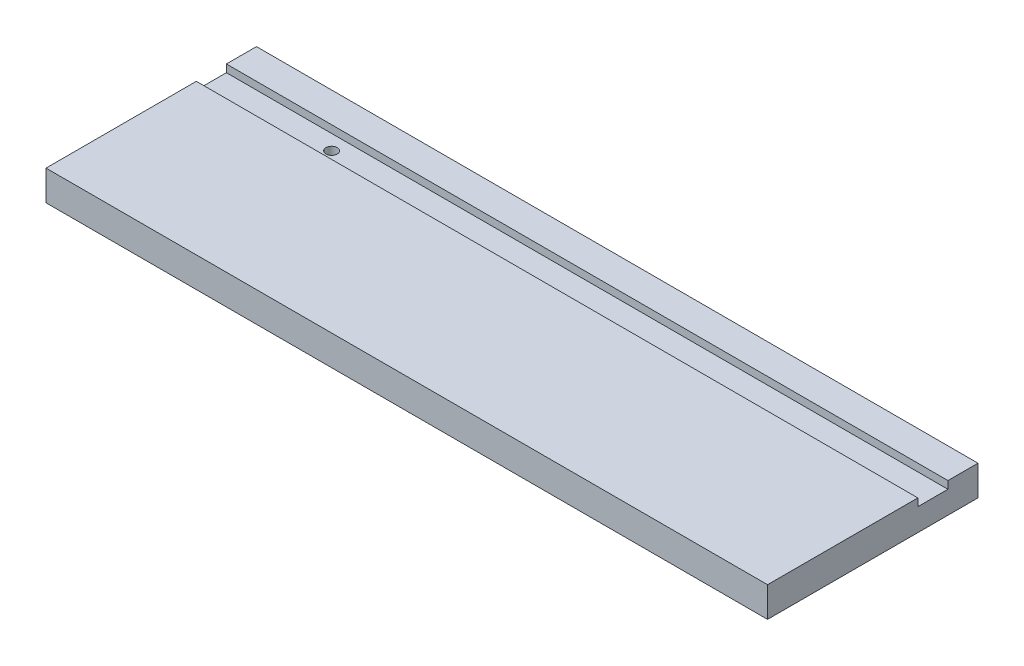
ISO-10303-21;
HEADER;
FILE_DESCRIPTION(('STEP AP214'),'2;1');
FILE_NAME('part.step','',(''),(''),'','','');
FILE_SCHEMA(('AUTOMOTIVE_DESIGN { 1 0 10303 214 1 1 1 1 }'));
ENDSEC;
DATA;
#1=APPLICATION_CONTEXT('core data for automotive mechanical design processes');
#2=APPLICATION_PROTOCOL_DEFINITION('international standard','automotive_design',2000,#1);
#3=PRODUCT_CONTEXT('',#1,'mechanical');
#4=PRODUCT('Part','Part','',(#3));
#5=PRODUCT_RELATED_PRODUCT_CATEGORY('part','',(#4));
#6=PRODUCT_DEFINITION_FORMATION('','',#4);
#7=PRODUCT_DEFINITION_CONTEXT('part definition',#1,'design');
#8=PRODUCT_DEFINITION('design','',#6,#7);
#9=PRODUCT_DEFINITION_SHAPE('','',#8);
#10=(LENGTH_UNIT() NAMED_UNIT(*) SI_UNIT(.MILLI.,.METRE.));
#11=(NAMED_UNIT(*) PLANE_ANGLE_UNIT() SI_UNIT($,.RADIAN.));
#12=(NAMED_UNIT(*) SI_UNIT($,.STERADIAN.) SOLID_ANGLE_UNIT());
#13=UNCERTAINTY_MEASURE_WITH_UNIT(LENGTH_MEASURE(1.E-05),#10,'distance_accuracy_value','');
#14=(GEOMETRIC_REPRESENTATION_CONTEXT(3) GLOBAL_UNCERTAINTY_ASSIGNED_CONTEXT((#13)) GLOBAL_UNIT_ASSIGNED_CONTEXT((#10,
#11,#12)) REPRESENTATION_CONTEXT('',''));
#15=CARTESIAN_POINT('',(0.,0.,0.));
#16=DIRECTION('',(0.,0.,1.));
#17=DIRECTION('',(1.,0.,0.));
#18=AXIS2_PLACEMENT_3D('',#15,#16,#17);
#19=CARTESIAN_POINT('',(152.4,6.35,0.));
#20=DIRECTION('',(-1.,0.,0.));
#21=DIRECTION('',(0.,0.,1.));
#22=AXIS2_PLACEMENT_3D('',#19,#20,#21);
#23=PLANE('',#22);
#24=DIRECTION('',(0.,1.,0.));
#25=VECTOR('',#24,1.);
#26=CARTESIAN_POINT('',(152.4,4.7498,-38.1));
#27=LINE('',#26,#25);
#28=CARTESIAN_POINT('',(152.4,4.7498,-38.1));
#29=VERTEX_POINT('',#28);
#30=CARTESIAN_POINT('',(152.4,6.35,-38.1));
#31=VERTEX_POINT('',#30);
#32=EDGE_CURVE('E128',#29,#31,#27,.T.);
#33=ORIENTED_EDGE('',*,*,#32,.F.);
#34=DIRECTION('',(0.,0.,-1.));
#35=VECTOR('',#34,1.);
#36=CARTESIAN_POINT('',(152.4,4.7498,0.));
#37=LINE('',#36,#35);
#38=CARTESIAN_POINT('',(152.4,4.7498,-31.75));
#39=VERTEX_POINT('',#38);
#40=EDGE_CURVE('E114',#39,#29,#37,.T.);
#41=ORIENTED_EDGE('',*,*,#40,.F.);
#42=DIRECTION('',(0.,1.,0.));
#43=VECTOR('',#42,1.);
#44=CARTESIAN_POINT('',(152.4,4.7498,-31.75));
#45=LINE('',#44,#43);
#46=CARTESIAN_POINT('',(152.4,6.35,-31.75));
#47=VERTEX_POINT('',#46);
#48=EDGE_CURVE('E123',#39,#47,#45,.T.);
#49=ORIENTED_EDGE('',*,*,#48,.T.);
#50=DIRECTION('',(0.,0.,-1.));
#51=VECTOR('',#50,1.);
#52=CARTESIAN_POINT('',(152.4,6.35,0.));
#53=LINE('',#52,#51);
#54=CARTESIAN_POINT('',(152.4,6.35,0.));
#55=VERTEX_POINT('',#54);
#56=EDGE_CURVE('E157',#55,#47,#53,.T.);
#57=ORIENTED_EDGE('',*,*,#56,.F.);
#58=DIRECTION('',(0.,-1.,0.));
#59=VECTOR('',#58,1.);
#60=CARTESIAN_POINT('',(152.4,6.35,0.));
#61=LINE('',#60,#59);
#62=CARTESIAN_POINT('',(152.4,0.,0.));
#63=VERTEX_POINT('',#62);
#64=EDGE_CURVE('E41',#55,#63,#61,.T.);
#65=ORIENTED_EDGE('',*,*,#64,.T.);
#66=DIRECTION('',(0.,0.,-1.));
#67=VECTOR('',#66,1.);
#68=CARTESIAN_POINT('',(152.4,0.,0.));
#69=LINE('',#68,#67);
#70=CARTESIAN_POINT('',(152.4,0.,-44.45));
#71=VERTEX_POINT('',#70);
#72=EDGE_CURVE('E67',#63,#71,#69,.T.);
#73=ORIENTED_EDGE('',*,*,#72,.T.);
#74=DIRECTION('',(0.,-1.,0.));
#75=VECTOR('',#74,1.);
#76=CARTESIAN_POINT('',(152.4,6.35,-44.45));
#77=LINE('',#76,#75);
#78=CARTESIAN_POINT('',(152.4,6.35,-44.45));
#79=VERTEX_POINT('',#78);
#80=EDGE_CURVE('E168',#79,#71,#77,.T.);
#81=ORIENTED_EDGE('',*,*,#80,.F.);
#82=EDGE_CURVE('E156',#31,#79,#53,.T.);
#83=ORIENTED_EDGE('',*,*,#82,.F.);
#84=EDGE_LOOP('',(#33,#41,#49,#57,#65,#73,#81,#83));
#85=FACE_BOUND('',#84,.T.);
#86=ADVANCED_FACE('F32',(#85),#23,.F.);
#87=CARTESIAN_POINT('',(0.,6.35,0.));
#88=DIRECTION('',(0.,-1.,0.));
#89=DIRECTION('',(0.,0.,-1.));
#90=AXIS2_PLACEMENT_3D('',#87,#88,#89);
#91=PLANE('',#90);
#92=DIRECTION('',(1.,0.,0.));
#93=VECTOR('',#92,1.);
#94=CARTESIAN_POINT('',(0.,6.35,-38.1));
#95=LINE('',#94,#93);
#96=CARTESIAN_POINT('',(0.,6.35,-38.1));
#97=VERTEX_POINT('',#96);
#98=EDGE_CURVE('E139',#97,#31,#95,.T.);
#99=ORIENTED_EDGE('',*,*,#98,.T.);
#100=ORIENTED_EDGE('',*,*,#82,.T.);
#101=DIRECTION('',(-1.,0.,0.));
#102=VECTOR('',#101,1.);
#103=CARTESIAN_POINT('',(0.,6.35,-44.45));
#104=LINE('',#103,#102);
#105=CARTESIAN_POINT('',(0.,6.35,-44.45));
#106=VERTEX_POINT('',#105);
#107=EDGE_CURVE('E49',#79,#106,#104,.T.);
#108=ORIENTED_EDGE('',*,*,#107,.T.);
#109=DIRECTION('',(0.,0.,1.));
#110=VECTOR('',#109,1.);
#111=CARTESIAN_POINT('',(0.,6.35,0.));
#112=LINE('',#111,#110);
#113=EDGE_CURVE('E152',#106,#97,#112,.T.);
#114=ORIENTED_EDGE('',*,*,#113,.T.);
#115=EDGE_LOOP('',(#99,#100,#108,#114));
#116=FACE_BOUND('',#115,.T.);
#117=ADVANCED_FACE('F178',(#116),#91,.F.);
#118=CARTESIAN_POINT('',(0.,6.35,0.));
#119=DIRECTION('',(1.,0.,0.));
#120=DIRECTION('',(0.,0.,-1.));
#121=AXIS2_PLACEMENT_3D('',#118,#119,#120);
#122=PLANE('',#121);
#123=CARTESIAN_POINT('',(0.,6.35,-31.75));
#124=VERTEX_POINT('',#123);
#125=CARTESIAN_POINT('',(0.,6.35,0.));
#126=VERTEX_POINT('',#125);
#127=EDGE_CURVE('E81',#124,#126,#112,.T.);
#128=ORIENTED_EDGE('',*,*,#127,.F.);
#129=DIRECTION('',(0.,1.,0.));
#130=VECTOR('',#129,1.);
#131=CARTESIAN_POINT('',(0.,4.7498,-31.75));
#132=LINE('',#131,#130);
#133=CARTESIAN_POINT('',(0.,4.7498,-31.75));
#134=VERTEX_POINT('',#133);
#135=EDGE_CURVE('E147',#134,#124,#132,.T.);
#136=ORIENTED_EDGE('',*,*,#135,.F.);
#137=DIRECTION('',(0.,0.,1.));
#138=VECTOR('',#137,1.);
#139=CARTESIAN_POINT('',(0.,4.7498,0.));
#140=LINE('',#139,#138);
#141=CARTESIAN_POINT('',(0.,4.7498,-38.1));
#142=VERTEX_POINT('',#141);
#143=EDGE_CURVE('E117',#142,#134,#140,.T.);
#144=ORIENTED_EDGE('',*,*,#143,.F.);
#145=DIRECTION('',(0.,1.,0.));
#146=VECTOR('',#145,1.);
#147=CARTESIAN_POINT('',(0.,4.7498,-38.1));
#148=LINE('',#147,#146);
#149=EDGE_CURVE('E120',#142,#97,#148,.T.);
#150=ORIENTED_EDGE('',*,*,#149,.T.);
#151=ORIENTED_EDGE('',*,*,#113,.F.);
#152=DIRECTION('',(0.,-1.,0.));
#153=VECTOR('',#152,1.);
#154=CARTESIAN_POINT('',(0.,6.35,-44.45));
#155=LINE('',#154,#153);
#156=CARTESIAN_POINT('',(0.,0.,-44.45));
#157=VERTEX_POINT('',#156);
#158=EDGE_CURVE('E160',#106,#157,#155,.T.);
#159=ORIENTED_EDGE('',*,*,#158,.T.);
#160=DIRECTION('',(0.,0.,1.));
#161=VECTOR('',#160,1.);
#162=CARTESIAN_POINT('',(0.,0.,0.));
#163=LINE('',#162,#161);
#164=CARTESIAN_POINT('',(0.,0.,0.));
#165=VERTEX_POINT('',#164);
#166=EDGE_CURVE('E149',#157,#165,#163,.T.);
#167=ORIENTED_EDGE('',*,*,#166,.T.);
#168=DIRECTION('',(0.,-1.,0.));
#169=VECTOR('',#168,1.);
#170=CARTESIAN_POINT('',(0.,6.35,0.));
#171=LINE('',#170,#169);
#172=EDGE_CURVE('E11',#126,#165,#171,.T.);
#173=ORIENTED_EDGE('',*,*,#172,.F.);
#174=EDGE_LOOP('',(#128,#136,#144,#150,#151,#159,#167,#173));
#175=FACE_BOUND('',#174,.T.);
#176=ADVANCED_FACE('F34',(#175),#122,.F.);
#177=CARTESIAN_POINT('',(0.,6.35,0.));
#178=DIRECTION('',(0.,0.,-1.));
#179=DIRECTION('',(-1.,0.,0.));
#180=AXIS2_PLACEMENT_3D('',#177,#178,#179);
#181=PLANE('',#180);
#182=DIRECTION('',(1.,0.,0.));
#183=VECTOR('',#182,1.);
#184=CARTESIAN_POINT('',(0.,0.,0.));
#185=LINE('',#184,#183);
#186=EDGE_CURVE('E163',#165,#63,#185,.T.);
#187=ORIENTED_EDGE('',*,*,#186,.T.);
#188=ORIENTED_EDGE('',*,*,#64,.F.);
#189=DIRECTION('',(1.,0.,0.));
#190=VECTOR('',#189,1.);
#191=CARTESIAN_POINT('',(0.,6.35,0.));
#192=LINE('',#191,#190);
#193=EDGE_CURVE('E154',#126,#55,#192,.T.);
#194=ORIENTED_EDGE('',*,*,#193,.F.);
#195=ORIENTED_EDGE('',*,*,#172,.T.);
#196=EDGE_LOOP('',(#187,#188,#194,#195));
#197=FACE_BOUND('',#196,.T.);
#198=ADVANCED_FACE('F182',(#197),#181,.F.);
#199=CARTESIAN_POINT('',(0.,6.35,-44.45));
#200=DIRECTION('',(0.,0.,1.));
#201=DIRECTION('',(1.,0.,0.));
#202=AXIS2_PLACEMENT_3D('',#199,#200,#201);
#203=PLANE('',#202);
#204=DIRECTION('',(-1.,0.,0.));
#205=VECTOR('',#204,1.);
#206=CARTESIAN_POINT('',(0.,0.,-44.45));
#207=LINE('',#206,#205);
#208=EDGE_CURVE('E73',#71,#157,#207,.T.);
#209=ORIENTED_EDGE('',*,*,#208,.T.);
#210=ORIENTED_EDGE('',*,*,#158,.F.);
#211=ORIENTED_EDGE('',*,*,#107,.F.);
#212=ORIENTED_EDGE('',*,*,#80,.T.);
#213=EDGE_LOOP('',(#209,#210,#211,#212));
#214=FACE_BOUND('',#213,.T.);
#215=ADVANCED_FACE('F177',(#214),#203,.F.);
#216=ORIENTED_EDGE('',*,*,#56,.T.);
#217=DIRECTION('',(1.,0.,0.));
#218=VECTOR('',#217,1.);
#219=CARTESIAN_POINT('',(0.,6.35,-31.75));
#220=LINE('',#219,#218);
#221=EDGE_CURVE('E125',#124,#47,#220,.T.);
#222=ORIENTED_EDGE('',*,*,#221,.F.);
#223=ORIENTED_EDGE('',*,*,#127,.T.);
#224=ORIENTED_EDGE('',*,*,#193,.T.);
#225=EDGE_LOOP('',(#216,#222,#223,#224));
#226=FACE_BOUND('',#225,.T.);
#227=ADVANCED_FACE('F181',(#226),#91,.F.);
#228=CARTESIAN_POINT('',(0.,0.,0.));
#229=DIRECTION('',(0.,-1.,0.));
#230=DIRECTION('',(0.,0.,-1.));
#231=AXIS2_PLACEMENT_3D('',#228,#229,#230);
#232=PLANE('',#231);
#233=CARTESIAN_POINT('',(25.4,0.,-34.925));
#234=DIRECTION('',(0.,1.,0.));
#235=DIRECTION('',(0.,0.,1.));
#236=AXIS2_PLACEMENT_3D('',#233,#234,#235);
#237=CIRCLE('',#236,1.18745);
#238=CARTESIAN_POINT('',(25.4,0.,-33.73755));
#239=VERTEX_POINT('',#238);
#240=EDGE_CURVE('E136',#239,#239,#237,.T.);
#241=ORIENTED_EDGE('',*,*,#240,.T.);
#242=EDGE_LOOP('',(#241));
#243=FACE_BOUND('',#242,.T.);
#244=ORIENTED_EDGE('',*,*,#166,.F.);
#245=ORIENTED_EDGE('',*,*,#208,.F.);
#246=ORIENTED_EDGE('',*,*,#72,.F.);
#247=ORIENTED_EDGE('',*,*,#186,.F.);
#248=EDGE_LOOP('',(#244,#245,#246,#247));
#249=FACE_BOUND('',#248,.T.);
#250=ADVANCED_FACE('F173',(#243,#249),#232,.T.);
#251=CARTESIAN_POINT('',(0.,4.7498,-31.75));
#252=DIRECTION('',(0.,0.,1.));
#253=DIRECTION('',(1.,0.,0.));
#254=AXIS2_PLACEMENT_3D('',#251,#252,#253);
#255=PLANE('',#254);
#256=ORIENTED_EDGE('',*,*,#221,.T.);
#257=ORIENTED_EDGE('',*,*,#48,.F.);
#258=DIRECTION('',(1.,0.,0.));
#259=VECTOR('',#258,1.);
#260=CARTESIAN_POINT('',(0.,4.7498,-31.75));
#261=LINE('',#260,#259);
#262=EDGE_CURVE('E109',#134,#39,#261,.T.);
#263=ORIENTED_EDGE('',*,*,#262,.F.);
#264=ORIENTED_EDGE('',*,*,#135,.T.);
#265=EDGE_LOOP('',(#256,#257,#263,#264));
#266=FACE_BOUND('',#265,.T.);
#267=ADVANCED_FACE('F124',(#266),#255,.F.);
#268=CARTESIAN_POINT('',(0.,4.7498,-38.1));
#269=DIRECTION('',(0.,0.,1.));
#270=DIRECTION('',(1.,0.,0.));
#271=AXIS2_PLACEMENT_3D('',#268,#269,#270);
#272=PLANE('',#271);
#273=ORIENTED_EDGE('',*,*,#98,.F.);
#274=ORIENTED_EDGE('',*,*,#149,.F.);
#275=DIRECTION('',(1.,0.,0.));
#276=VECTOR('',#275,1.);
#277=CARTESIAN_POINT('',(0.,4.7498,-38.1));
#278=LINE('',#277,#276);
#279=EDGE_CURVE('E142',#142,#29,#278,.T.);
#280=ORIENTED_EDGE('',*,*,#279,.T.);
#281=ORIENTED_EDGE('',*,*,#32,.T.);
#282=EDGE_LOOP('',(#273,#274,#280,#281));
#283=FACE_BOUND('',#282,.T.);
#284=ADVANCED_FACE('F180',(#283),#272,.T.);
#285=CARTESIAN_POINT('',(0.,4.7498,0.));
#286=DIRECTION('',(0.,1.,0.));
#287=DIRECTION('',(0.,0.,1.));
#288=AXIS2_PLACEMENT_3D('',#285,#286,#287);
#289=PLANE('',#288);
#290=CARTESIAN_POINT('',(25.4,4.7498,-34.925));
#291=DIRECTION('',(0.,1.,0.));
#292=DIRECTION('',(0.,0.,1.));
#293=AXIS2_PLACEMENT_3D('',#290,#291,#292);
#294=CIRCLE('',#293,1.18745);
#295=CARTESIAN_POINT('',(25.4,4.7498,-33.73755));
#296=VERTEX_POINT('',#295);
#297=EDGE_CURVE('E134',#296,#296,#294,.T.);
#298=ORIENTED_EDGE('',*,*,#297,.F.);
#299=EDGE_LOOP('',(#298));
#300=FACE_BOUND('',#299,.T.);
#301=ORIENTED_EDGE('',*,*,#262,.T.);
#302=ORIENTED_EDGE('',*,*,#40,.T.);
#303=ORIENTED_EDGE('',*,*,#279,.F.);
#304=ORIENTED_EDGE('',*,*,#143,.T.);
#305=EDGE_LOOP('',(#301,#302,#303,#304));
#306=FACE_BOUND('',#305,.T.);
#307=ADVANCED_FACE('F111',(#300,#306),#289,.T.);
#308=CARTESIAN_POINT('',(25.4,0.,-34.925));
#309=DIRECTION('',(0.,1.,0.));
#310=DIRECTION('',(0.,0.,1.));
#311=AXIS2_PLACEMENT_3D('',#308,#309,#310);
#312=CYLINDRICAL_SURFACE('',#311,1.18745);
#313=ORIENTED_EDGE('',*,*,#240,.F.);
#314=EDGE_LOOP('',(#313));
#315=FACE_BOUND('',#314,.T.);
#316=ORIENTED_EDGE('',*,*,#297,.T.);
#317=EDGE_LOOP('',(#316));
#318=FACE_BOUND('',#317,.T.);
#319=ADVANCED_FACE('F206',(#315,#318),#312,.F.);
#320=CLOSED_SHELL('',(#86,#117,#176,#198,#215,#227,#250,#267,#284,#307,#319));
#321=MANIFOLD_SOLID_BREP('B2',#320);
#322=ADVANCED_BREP_SHAPE_REPRESENTATION('',(#18,#321),#14);
#323=SHAPE_DEFINITION_REPRESENTATION(#9,#322);
ENDSEC;
END-ISO-10303-21;
